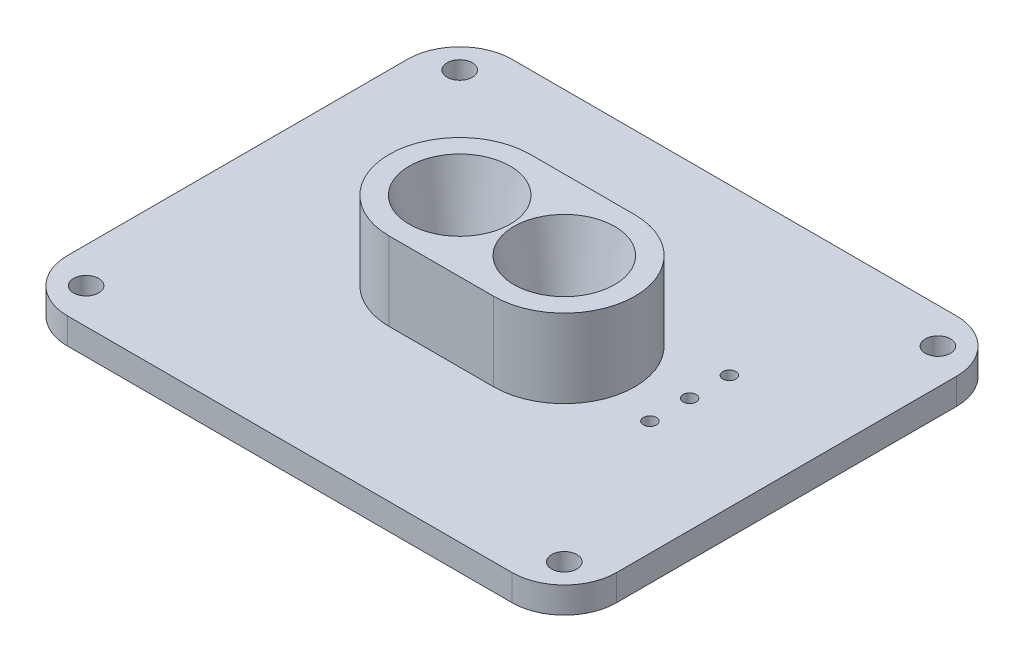
ISO-10303-21;
HEADER;
FILE_DESCRIPTION(('STEP AP214'),'2;1');
FILE_NAME('part.step','',(''),(''),'','','');
FILE_SCHEMA(('AUTOMOTIVE_DESIGN { 1 0 10303 214 1 1 1 1 }'));
ENDSEC;
DATA;
#1=APPLICATION_CONTEXT('core data for automotive mechanical design processes');
#2=APPLICATION_PROTOCOL_DEFINITION('international standard','automotive_design',2000,#1);
#3=PRODUCT_CONTEXT('',#1,'mechanical');
#4=PRODUCT('Part','Part','',(#3));
#5=PRODUCT_RELATED_PRODUCT_CATEGORY('part','',(#4));
#6=PRODUCT_DEFINITION_FORMATION('','',#4);
#7=PRODUCT_DEFINITION_CONTEXT('part definition',#1,'design');
#8=PRODUCT_DEFINITION('design','',#6,#7);
#9=PRODUCT_DEFINITION_SHAPE('','',#8);
#10=(LENGTH_UNIT() NAMED_UNIT(*) SI_UNIT(.MILLI.,.METRE.));
#11=(NAMED_UNIT(*) PLANE_ANGLE_UNIT() SI_UNIT($,.RADIAN.));
#12=(NAMED_UNIT(*) SI_UNIT($,.STERADIAN.) SOLID_ANGLE_UNIT());
#13=UNCERTAINTY_MEASURE_WITH_UNIT(LENGTH_MEASURE(1.E-05),#10,'distance_accuracy_value','');
#14=(GEOMETRIC_REPRESENTATION_CONTEXT(3) GLOBAL_UNCERTAINTY_ASSIGNED_CONTEXT((#13)) GLOBAL_UNIT_ASSIGNED_CONTEXT((#10,
#11,#12)) REPRESENTATION_CONTEXT('',''));
#15=CARTESIAN_POINT('',(0.,0.,0.));
#16=DIRECTION('',(0.,0.,1.));
#17=DIRECTION('',(1.,0.,0.));
#18=AXIS2_PLACEMENT_3D('',#15,#16,#17);
#19=CARTESIAN_POINT('',(-19.6451080879502,97.8379830194114,147.403503967917));
#20=DIRECTION('',(0.,1.,0.));
#21=DIRECTION('',(0.,0.,1.));
#22=AXIS2_PLACEMENT_3D('',#19,#20,#21);
#23=PLANE('',#22);
#24=CARTESIAN_POINT('',(73.2236419120498,97.8379830194114,111.526003967917));
#25=DIRECTION('',(0.,1.,0.));
#26=DIRECTION('',(0.,0.,1.));
#27=AXIS2_PLACEMENT_3D('',#24,#25,#26);
#28=CIRCLE('',#27,1.58749999999999);
#29=CARTESIAN_POINT('',(73.2236419120498,97.8379830194114,113.113503967917));
#30=VERTEX_POINT('',#29);
#31=EDGE_CURVE('E208',#30,#30,#28,.T.);
#32=ORIENTED_EDGE('',*,*,#31,.F.);
#33=EDGE_LOOP('',(#32));
#34=FACE_BOUND('',#33,.T.);
#35=CARTESIAN_POINT('',(73.2236419120498,97.8379830194114,101.874003967917));
#36=DIRECTION('',(0.,1.,0.));
#37=DIRECTION('',(0.,0.,1.));
#38=AXIS2_PLACEMENT_3D('',#35,#36,#37);
#39=CIRCLE('',#38,1.58749999999999);
#40=CARTESIAN_POINT('',(73.2236419120498,97.8379830194114,103.461503967917));
#41=VERTEX_POINT('',#40);
#42=EDGE_CURVE('E214',#41,#41,#39,.T.);
#43=ORIENTED_EDGE('',*,*,#42,.F.);
#44=EDGE_LOOP('',(#43));
#45=FACE_BOUND('',#44,.T.);
#46=CARTESIAN_POINT('',(73.2236419120498,97.8379830194114,92.2220039679169));
#47=DIRECTION('',(0.,1.,0.));
#48=DIRECTION('',(0.,0.,1.));
#49=AXIS2_PLACEMENT_3D('',#46,#47,#48);
#50=CIRCLE('',#49,1.58749999999999);
#51=CARTESIAN_POINT('',(73.2236419120498,97.8379830194114,93.8095039679169));
#52=VERTEX_POINT('',#51);
#53=EDGE_CURVE('E192',#52,#52,#50,.T.);
#54=ORIENTED_EDGE('',*,*,#53,.F.);
#55=EDGE_LOOP('',(#54));
#56=FACE_BOUND('',#55,.T.);
#57=CARTESIAN_POINT('',(92.4006419120498,97.8379830194114,151.499253967917));
#58=DIRECTION('',(0.,1.,0.));
#59=DIRECTION('',(0.,0.,1.));
#60=AXIS2_PLACEMENT_3D('',#57,#58,#59);
#61=CIRCLE('',#60,3.0607);
#62=CARTESIAN_POINT('',(92.4006419120498,97.8379830194114,154.559953967917));
#63=VERTEX_POINT('',#62);
#64=EDGE_CURVE('E262',#63,#63,#61,.T.);
#65=ORIENTED_EDGE('',*,*,#64,.F.);
#66=EDGE_LOOP('',(#65));
#67=FACE_BOUND('',#66,.T.);
#68=CARTESIAN_POINT('',(-23.7408580879502,97.8379830194114,60.7577539679169));
#69=DIRECTION('',(0.,1.,0.));
#70=DIRECTION('',(0.,0.,1.));
#71=AXIS2_PLACEMENT_3D('',#68,#69,#70);
#72=CIRCLE('',#71,3.06069999999998);
#73=CARTESIAN_POINT('',(-23.7408580879502,97.8379830194114,63.8184539679169));
#74=VERTEX_POINT('',#73);
#75=EDGE_CURVE('E274',#74,#74,#72,.T.);
#76=ORIENTED_EDGE('',*,*,#75,.F.);
#77=EDGE_LOOP('',(#76));
#78=FACE_BOUND('',#77,.T.);
#79=CARTESIAN_POINT('',(-23.7408580879502,97.8379830194114,151.499253967917));
#80=DIRECTION('',(0.,1.,0.));
#81=DIRECTION('',(0.,0.,1.));
#82=AXIS2_PLACEMENT_3D('',#79,#80,#81);
#83=CIRCLE('',#82,3.06069999999999);
#84=CARTESIAN_POINT('',(-23.7408580879502,97.8379830194114,154.559953967917));
#85=VERTEX_POINT('',#84);
#86=EDGE_CURVE('E11',#85,#85,#83,.T.);
#87=ORIENTED_EDGE('',*,*,#86,.F.);
#88=EDGE_LOOP('',(#87));
#89=FACE_BOUND('',#88,.T.);
#90=CARTESIAN_POINT('',(92.4006419120498,97.8379830194114,60.7577539679169));
#91=DIRECTION('',(0.,1.,0.));
#92=DIRECTION('',(0.,0.,1.));
#93=AXIS2_PLACEMENT_3D('',#90,#91,#92);
#94=CIRCLE('',#93,3.06069999999999);
#95=CARTESIAN_POINT('',(92.4006419120498,97.8379830194114,63.8184539679169));
#96=VERTEX_POINT('',#95);
#97=EDGE_CURVE('E268',#96,#96,#94,.T.);
#98=ORIENTED_EDGE('',*,*,#97,.F.);
#99=EDGE_LOOP('',(#98));
#100=FACE_BOUND('',#99,.T.);
#101=DIRECTION('',(1.,0.,0.));
#102=VECTOR('',#101,1.);
#103=CARTESIAN_POINT('',(21.6298919120498,97.8379830194114,123.273503967917));
#104=LINE('',#103,#102);
#105=CARTESIAN_POINT('',(21.6298919120498,97.8379830194114,123.273503967917));
#106=VERTEX_POINT('',#105);
#107=CARTESIAN_POINT('',(47.0298919120498,97.8379830194114,123.273503967917));
#108=VERTEX_POINT('',#107);
#109=EDGE_CURVE('E243',#106,#108,#104,.T.);
#110=ORIENTED_EDGE('',*,*,#109,.F.);
#111=CARTESIAN_POINT('',(21.6298919120498,97.8379830194114,106.128503967917));
#112=DIRECTION('',(0.,1.,0.));
#113=DIRECTION('',(0.,0.,1.));
#114=AXIS2_PLACEMENT_3D('',#111,#112,#113);
#115=CIRCLE('',#114,17.145);
#116=CARTESIAN_POINT('',(21.6298919120498,97.8379830194114,88.9835039679169));
#117=VERTEX_POINT('',#116);
#118=EDGE_CURVE('E229',#117,#106,#115,.T.);
#119=ORIENTED_EDGE('',*,*,#118,.F.);
#120=DIRECTION('',(-1.,0.,0.));
#121=VECTOR('',#120,1.);
#122=CARTESIAN_POINT('',(21.6298919120498,97.8379830194114,88.9835039679169));
#123=LINE('',#122,#121);
#124=CARTESIAN_POINT('',(47.0298919120498,97.8379830194114,88.9835039679169));
#125=VERTEX_POINT('',#124);
#126=EDGE_CURVE('E71',#125,#117,#123,.T.);
#127=ORIENTED_EDGE('',*,*,#126,.F.);
#128=CARTESIAN_POINT('',(47.0298919120498,97.8379830194114,106.128503967917));
#129=DIRECTION('',(0.,1.,0.));
#130=DIRECTION('',(0.,0.,1.));
#131=AXIS2_PLACEMENT_3D('',#128,#129,#130);
#132=CIRCLE('',#131,17.145);
#133=EDGE_CURVE('E245',#108,#125,#132,.T.);
#134=ORIENTED_EDGE('',*,*,#133,.F.);
#135=EDGE_LOOP('',(#110,#119,#127,#134));
#136=FACE_BOUND('',#135,.T.);
#137=CARTESIAN_POINT('',(-19.6451080879502,97.8379830194114,64.8535039679169));
#138=DIRECTION('',(0.,1.,0.));
#139=DIRECTION('',(0.,0.,1.));
#140=AXIS2_PLACEMENT_3D('',#137,#138,#139);
#141=CIRCLE('',#140,12.7);
#142=CARTESIAN_POINT('',(-19.6451080879501,97.8379830194114,52.1535039679169));
#143=VERTEX_POINT('',#142);
#144=CARTESIAN_POINT('',(-32.3451080879502,97.8379830194114,64.853503967917));
#145=VERTEX_POINT('',#144);
#146=EDGE_CURVE('E174',#143,#145,#141,.T.);
#147=ORIENTED_EDGE('',*,*,#146,.T.);
#148=DIRECTION('',(0.,0.,1.));
#149=VECTOR('',#148,1.);
#150=CARTESIAN_POINT('',(-32.3451080879502,97.8379830194114,64.853503967917));
#151=LINE('',#150,#149);
#152=CARTESIAN_POINT('',(-32.3451080879502,97.8379830194114,147.403503967917));
#153=VERTEX_POINT('',#152);
#154=EDGE_CURVE('E134',#145,#153,#151,.T.);
#155=ORIENTED_EDGE('',*,*,#154,.T.);
#156=CARTESIAN_POINT('',(-19.6451080879502,97.8379830194114,147.403503967917));
#157=DIRECTION('',(0.,1.,0.));
#158=DIRECTION('',(0.,0.,1.));
#159=AXIS2_PLACEMENT_3D('',#156,#157,#158);
#160=CIRCLE('',#159,12.7);
#161=CARTESIAN_POINT('',(-19.6451080879502,97.8379830194114,160.103503967917));
#162=VERTEX_POINT('',#161);
#163=EDGE_CURVE('E177',#153,#162,#160,.T.);
#164=ORIENTED_EDGE('',*,*,#163,.T.);
#165=DIRECTION('',(1.,0.,0.));
#166=VECTOR('',#165,1.);
#167=CARTESIAN_POINT('',(-19.6451080879501,97.8379830194114,160.103503967917));
#168=LINE('',#167,#166);
#169=CARTESIAN_POINT('',(88.3048919120497,97.8379830194114,160.103503967917));
#170=VERTEX_POINT('',#169);
#171=EDGE_CURVE('E180',#162,#170,#168,.T.);
#172=ORIENTED_EDGE('',*,*,#171,.T.);
#173=CARTESIAN_POINT('',(88.3048919120498,97.8379830194114,147.403503967917));
#174=DIRECTION('',(0.,1.,0.));
#175=DIRECTION('',(0.,0.,1.));
#176=AXIS2_PLACEMENT_3D('',#173,#174,#175);
#177=CIRCLE('',#176,12.7);
#178=CARTESIAN_POINT('',(101.00489191205,97.8379830194114,147.403503967917));
#179=VERTEX_POINT('',#178);
#180=EDGE_CURVE('E183',#170,#179,#177,.T.);
#181=ORIENTED_EDGE('',*,*,#180,.T.);
#182=DIRECTION('',(0.,0.,-1.));
#183=VECTOR('',#182,1.);
#184=CARTESIAN_POINT('',(101.00489191205,97.8379830194114,147.403503967917));
#185=LINE('',#184,#183);
#186=CARTESIAN_POINT('',(101.00489191205,97.8379830194114,64.853503967917));
#187=VERTEX_POINT('',#186);
#188=EDGE_CURVE('E186',#179,#187,#185,.T.);
#189=ORIENTED_EDGE('',*,*,#188,.T.);
#190=CARTESIAN_POINT('',(88.3048919120498,97.8379830194114,64.8535039679169));
#191=DIRECTION('',(0.,1.,0.));
#192=DIRECTION('',(0.,0.,1.));
#193=AXIS2_PLACEMENT_3D('',#190,#191,#192);
#194=CIRCLE('',#193,12.7);
#195=CARTESIAN_POINT('',(88.3048919120497,97.8379830194114,52.1535039679169));
#196=VERTEX_POINT('',#195);
#197=EDGE_CURVE('E157',#187,#196,#194,.T.);
#198=ORIENTED_EDGE('',*,*,#197,.T.);
#199=DIRECTION('',(-1.,0.,0.));
#200=VECTOR('',#199,1.);
#201=CARTESIAN_POINT('',(88.3048919120497,97.8379830194114,52.1535039679169));
#202=LINE('',#201,#200);
#203=EDGE_CURVE('E154',#196,#143,#202,.T.);
#204=ORIENTED_EDGE('',*,*,#203,.T.);
#205=EDGE_LOOP('',(#147,#155,#164,#172,#181,#189,#198,#204));
#206=FACE_BOUND('',#205,.T.);
#207=ADVANCED_FACE('F33',(#34,#45,#56,#67,#78,#89,#100,#136,#206),#23,.T.);
#208=CARTESIAN_POINT('',(-19.6451080879502,91.4879830194114,147.403503967917));
#209=DIRECTION('',(0.,1.,0.));
#210=DIRECTION('',(0.,0.,1.));
#211=AXIS2_PLACEMENT_3D('',#208,#209,#210);
#212=PLANE('',#211);
#213=CARTESIAN_POINT('',(73.2236419120498,91.4879830194114,111.526003967917));
#214=DIRECTION('',(0.,1.,0.));
#215=DIRECTION('',(0.,0.,1.));
#216=AXIS2_PLACEMENT_3D('',#213,#214,#215);
#217=CIRCLE('',#216,1.58749999999999);
#218=CARTESIAN_POINT('',(73.2236419120498,91.4879830194114,113.113503967917));
#219=VERTEX_POINT('',#218);
#220=EDGE_CURVE('E204',#219,#219,#217,.T.);
#221=ORIENTED_EDGE('',*,*,#220,.T.);
#222=EDGE_LOOP('',(#221));
#223=FACE_BOUND('',#222,.T.);
#224=CARTESIAN_POINT('',(73.2236419120498,91.4879830194114,101.874003967917));
#225=DIRECTION('',(0.,1.,0.));
#226=DIRECTION('',(0.,0.,1.));
#227=AXIS2_PLACEMENT_3D('',#224,#225,#226);
#228=CIRCLE('',#227,1.58749999999999);
#229=CARTESIAN_POINT('',(73.2236419120498,91.4879830194114,103.461503967917));
#230=VERTEX_POINT('',#229);
#231=EDGE_CURVE('E211',#230,#230,#228,.T.);
#232=ORIENTED_EDGE('',*,*,#231,.T.);
#233=EDGE_LOOP('',(#232));
#234=FACE_BOUND('',#233,.T.);
#235=CARTESIAN_POINT('',(73.2236419120498,91.4879830194114,92.2220039679169));
#236=DIRECTION('',(0.,1.,0.));
#237=DIRECTION('',(0.,0.,1.));
#238=AXIS2_PLACEMENT_3D('',#235,#236,#237);
#239=CIRCLE('',#238,1.58749999999999);
#240=CARTESIAN_POINT('',(73.2236419120498,91.4879830194114,93.8095039679169));
#241=VERTEX_POINT('',#240);
#242=EDGE_CURVE('E217',#241,#241,#239,.T.);
#243=ORIENTED_EDGE('',*,*,#242,.T.);
#244=EDGE_LOOP('',(#243));
#245=FACE_BOUND('',#244,.T.);
#246=CARTESIAN_POINT('',(47.0298919120498,91.4879830194114,106.128503967917));
#247=DIRECTION('',(0.,-1.,0.));
#248=DIRECTION('',(0.,0.,-1.));
#249=AXIS2_PLACEMENT_3D('',#246,#247,#248);
#250=CIRCLE('',#249,8.20039);
#251=CARTESIAN_POINT('',(47.0298919120498,91.4879830194114,97.9281139679169));
#252=VERTEX_POINT('',#251);
#253=EDGE_CURVE('E256',#252,#252,#250,.T.);
#254=ORIENTED_EDGE('',*,*,#253,.F.);
#255=EDGE_LOOP('',(#254));
#256=FACE_BOUND('',#255,.T.);
#257=CARTESIAN_POINT('',(21.6298919120498,91.4879830194114,106.128503967917));
#258=DIRECTION('',(0.,-1.,0.));
#259=DIRECTION('',(0.,0.,-1.));
#260=AXIS2_PLACEMENT_3D('',#257,#258,#259);
#261=CIRCLE('',#260,8.20039);
#262=CARTESIAN_POINT('',(21.6298919120498,91.4879830194114,97.9281139679169));
#263=VERTEX_POINT('',#262);
#264=EDGE_CURVE('E255',#263,#263,#261,.T.);
#265=ORIENTED_EDGE('',*,*,#264,.F.);
#266=EDGE_LOOP('',(#265));
#267=FACE_BOUND('',#266,.T.);
#268=CARTESIAN_POINT('',(-23.7408580879502,91.4879830194114,151.499253967917));
#269=DIRECTION('',(0.,1.,0.));
#270=DIRECTION('',(0.,0.,1.));
#271=AXIS2_PLACEMENT_3D('',#268,#269,#270);
#272=CIRCLE('',#271,3.06069999999999);
#273=CARTESIAN_POINT('',(-23.7408580879502,91.4879830194114,154.559953967917));
#274=VERTEX_POINT('',#273);
#275=EDGE_CURVE('E37',#274,#274,#272,.T.);
#276=ORIENTED_EDGE('',*,*,#275,.T.);
#277=EDGE_LOOP('',(#276));
#278=FACE_BOUND('',#277,.T.);
#279=CARTESIAN_POINT('',(-23.7408580879502,91.4879830194114,60.7577539679169));
#280=DIRECTION('',(0.,1.,0.));
#281=DIRECTION('',(0.,0.,1.));
#282=AXIS2_PLACEMENT_3D('',#279,#280,#281);
#283=CIRCLE('',#282,3.06069999999998);
#284=CARTESIAN_POINT('',(-23.7408580879502,91.4879830194114,63.8184539679169));
#285=VERTEX_POINT('',#284);
#286=EDGE_CURVE('E271',#285,#285,#283,.T.);
#287=ORIENTED_EDGE('',*,*,#286,.T.);
#288=EDGE_LOOP('',(#287));
#289=FACE_BOUND('',#288,.T.);
#290=CARTESIAN_POINT('',(92.4006419120498,91.4879830194114,60.7577539679169));
#291=DIRECTION('',(0.,1.,0.));
#292=DIRECTION('',(0.,0.,1.));
#293=AXIS2_PLACEMENT_3D('',#290,#291,#292);
#294=CIRCLE('',#293,3.06069999999999);
#295=CARTESIAN_POINT('',(92.4006419120498,91.4879830194114,63.8184539679169));
#296=VERTEX_POINT('',#295);
#297=EDGE_CURVE('E265',#296,#296,#294,.T.);
#298=ORIENTED_EDGE('',*,*,#297,.T.);
#299=EDGE_LOOP('',(#298));
#300=FACE_BOUND('',#299,.T.);
#301=CARTESIAN_POINT('',(92.4006419120498,91.4879830194114,151.499253967917));
#302=DIRECTION('',(0.,1.,0.));
#303=DIRECTION('',(0.,0.,1.));
#304=AXIS2_PLACEMENT_3D('',#301,#302,#303);
#305=CIRCLE('',#304,3.0607);
#306=CARTESIAN_POINT('',(92.4006419120498,91.4879830194114,154.559953967917));
#307=VERTEX_POINT('',#306);
#308=EDGE_CURVE('E259',#307,#307,#305,.T.);
#309=ORIENTED_EDGE('',*,*,#308,.T.);
#310=EDGE_LOOP('',(#309));
#311=FACE_BOUND('',#310,.T.);
#312=CARTESIAN_POINT('',(-19.6451080879502,91.4879830194114,64.8535039679169));
#313=DIRECTION('',(0.,1.,0.));
#314=DIRECTION('',(0.,0.,1.));
#315=AXIS2_PLACEMENT_3D('',#312,#313,#314);
#316=CIRCLE('',#315,12.7);
#317=CARTESIAN_POINT('',(-19.6451080879501,91.4879830194114,52.1535039679169));
#318=VERTEX_POINT('',#317);
#319=CARTESIAN_POINT('',(-32.3451080879502,91.4879830194114,64.853503967917));
#320=VERTEX_POINT('',#319);
#321=EDGE_CURVE('E146',#318,#320,#316,.T.);
#322=ORIENTED_EDGE('',*,*,#321,.F.);
#323=DIRECTION('',(-1.,0.,0.));
#324=VECTOR('',#323,1.);
#325=CARTESIAN_POINT('',(88.3048919120497,91.4879830194114,52.1535039679169));
#326=LINE('',#325,#324);
#327=CARTESIAN_POINT('',(88.3048919120497,91.4879830194114,52.1535039679169));
#328=VERTEX_POINT('',#327);
#329=EDGE_CURVE('E140',#328,#318,#326,.T.);
#330=ORIENTED_EDGE('',*,*,#329,.F.);
#331=CARTESIAN_POINT('',(88.3048919120498,91.4879830194114,64.8535039679169));
#332=DIRECTION('',(0.,1.,0.));
#333=DIRECTION('',(0.,0.,1.));
#334=AXIS2_PLACEMENT_3D('',#331,#332,#333);
#335=CIRCLE('',#334,12.7);
#336=CARTESIAN_POINT('',(101.00489191205,91.4879830194114,64.853503967917));
#337=VERTEX_POINT('',#336);
#338=EDGE_CURVE('E170',#337,#328,#335,.T.);
#339=ORIENTED_EDGE('',*,*,#338,.F.);
#340=DIRECTION('',(0.,0.,-1.));
#341=VECTOR('',#340,1.);
#342=CARTESIAN_POINT('',(101.00489191205,91.4879830194114,147.403503967917));
#343=LINE('',#342,#341);
#344=CARTESIAN_POINT('',(101.00489191205,91.4879830194114,147.403503967917));
#345=VERTEX_POINT('',#344);
#346=EDGE_CURVE('E167',#345,#337,#343,.T.);
#347=ORIENTED_EDGE('',*,*,#346,.F.);
#348=CARTESIAN_POINT('',(88.3048919120498,91.4879830194114,147.403503967917));
#349=DIRECTION('',(0.,1.,0.));
#350=DIRECTION('',(0.,0.,1.));
#351=AXIS2_PLACEMENT_3D('',#348,#349,#350);
#352=CIRCLE('',#351,12.7);
#353=CARTESIAN_POINT('',(88.3048919120497,91.4879830194114,160.103503967917));
#354=VERTEX_POINT('',#353);
#355=EDGE_CURVE('E164',#354,#345,#352,.T.);
#356=ORIENTED_EDGE('',*,*,#355,.F.);
#357=DIRECTION('',(1.,0.,0.));
#358=VECTOR('',#357,1.);
#359=CARTESIAN_POINT('',(-19.6451080879501,91.4879830194114,160.103503967917));
#360=LINE('',#359,#358);
#361=CARTESIAN_POINT('',(-19.6451080879502,91.4879830194114,160.103503967917));
#362=VERTEX_POINT('',#361);
#363=EDGE_CURVE('E161',#362,#354,#360,.T.);
#364=ORIENTED_EDGE('',*,*,#363,.F.);
#365=CARTESIAN_POINT('',(-19.6451080879502,91.4879830194114,147.403503967917));
#366=DIRECTION('',(0.,1.,0.));
#367=DIRECTION('',(0.,0.,1.));
#368=AXIS2_PLACEMENT_3D('',#365,#366,#367);
#369=CIRCLE('',#368,12.7);
#370=CARTESIAN_POINT('',(-32.3451080879502,91.4879830194114,147.403503967917));
#371=VERTEX_POINT('',#370);
#372=EDGE_CURVE('E150',#371,#362,#369,.T.);
#373=ORIENTED_EDGE('',*,*,#372,.F.);
#374=DIRECTION('',(0.,0.,1.));
#375=VECTOR('',#374,1.);
#376=CARTESIAN_POINT('',(-32.3451080879502,91.4879830194114,64.853503967917));
#377=LINE('',#376,#375);
#378=EDGE_CURVE('E132',#320,#371,#377,.T.);
#379=ORIENTED_EDGE('',*,*,#378,.F.);
#380=EDGE_LOOP('',(#322,#330,#339,#347,#356,#364,#373,#379));
#381=FACE_BOUND('',#380,.T.);
#382=ADVANCED_FACE('F35',(#223,#234,#245,#256,#267,#278,#289,#300,#311,#381),#212,.F.);
#383=CARTESIAN_POINT('',(-23.7408580879502,97.8379830194114,151.499253967917));
#384=DIRECTION('',(0.,-1.,0.));
#385=DIRECTION('',(0.,0.,-1.));
#386=AXIS2_PLACEMENT_3D('',#383,#384,#385);
#387=CYLINDRICAL_SURFACE('',#386,3.06069999999999);
#388=ORIENTED_EDGE('',*,*,#86,.T.);
#389=EDGE_LOOP('',(#388));
#390=FACE_BOUND('',#389,.T.);
#391=ORIENTED_EDGE('',*,*,#275,.F.);
#392=EDGE_LOOP('',(#391));
#393=FACE_BOUND('',#392,.T.);
#394=ADVANCED_FACE('F285',(#390,#393),#387,.F.);
#395=CARTESIAN_POINT('',(-23.7408580879502,97.8379830194114,60.7577539679169));
#396=DIRECTION('',(0.,-1.,0.));
#397=DIRECTION('',(0.,0.,-1.));
#398=AXIS2_PLACEMENT_3D('',#395,#396,#397);
#399=CYLINDRICAL_SURFACE('',#398,3.06069999999998);
#400=ORIENTED_EDGE('',*,*,#75,.T.);
#401=EDGE_LOOP('',(#400));
#402=FACE_BOUND('',#401,.T.);
#403=ORIENTED_EDGE('',*,*,#286,.F.);
#404=EDGE_LOOP('',(#403));
#405=FACE_BOUND('',#404,.T.);
#406=ADVANCED_FACE('F282',(#402,#405),#399,.F.);
#407=CARTESIAN_POINT('',(92.4006419120498,97.8379830194114,60.7577539679169));
#408=DIRECTION('',(0.,-1.,0.));
#409=DIRECTION('',(0.,0.,-1.));
#410=AXIS2_PLACEMENT_3D('',#407,#408,#409);
#411=CYLINDRICAL_SURFACE('',#410,3.06069999999999);
#412=ORIENTED_EDGE('',*,*,#97,.T.);
#413=EDGE_LOOP('',(#412));
#414=FACE_BOUND('',#413,.T.);
#415=ORIENTED_EDGE('',*,*,#297,.F.);
#416=EDGE_LOOP('',(#415));
#417=FACE_BOUND('',#416,.T.);
#418=ADVANCED_FACE('F284',(#414,#417),#411,.F.);
#419=CARTESIAN_POINT('',(92.4006419120498,97.8379830194114,151.499253967917));
#420=DIRECTION('',(0.,-1.,0.));
#421=DIRECTION('',(0.,0.,-1.));
#422=AXIS2_PLACEMENT_3D('',#419,#420,#421);
#423=CYLINDRICAL_SURFACE('',#422,3.0607);
#424=ORIENTED_EDGE('',*,*,#64,.T.);
#425=EDGE_LOOP('',(#424));
#426=FACE_BOUND('',#425,.T.);
#427=ORIENTED_EDGE('',*,*,#308,.F.);
#428=EDGE_LOOP('',(#427));
#429=FACE_BOUND('',#428,.T.);
#430=ADVANCED_FACE('F292',(#426,#429),#423,.F.);
#431=CARTESIAN_POINT('',(21.6298919120498,97.8379830194114,106.128503967917));
#432=DIRECTION('',(0.,-1.,0.));
#433=DIRECTION('',(0.,0.,-1.));
#434=AXIS2_PLACEMENT_3D('',#431,#432,#433);
#435=CYLINDRICAL_SURFACE('',#434,8.20039);
#436=CARTESIAN_POINT('',(21.6298919120498,97.8379830194114,106.128503967917));
#437=DIRECTION('',(0.,-1.,0.));
#438=DIRECTION('',(0.,0.,-1.));
#439=AXIS2_PLACEMENT_3D('',#436,#437,#438);
#440=CIRCLE('',#439,8.20039);
#441=CARTESIAN_POINT('',(21.6298919120498,97.8379830194114,97.9281139679169));
#442=VERTEX_POINT('',#441);
#443=EDGE_CURVE('E222',#442,#442,#440,.T.);
#444=ORIENTED_EDGE('',*,*,#443,.F.);
#445=EDGE_LOOP('',(#444));
#446=FACE_BOUND('',#445,.T.);
#447=ORIENTED_EDGE('',*,*,#264,.T.);
#448=EDGE_LOOP('',(#447));
#449=FACE_BOUND('',#448,.T.);
#450=ADVANCED_FACE('F394',(#446,#449),#435,.F.);
#451=CARTESIAN_POINT('',(47.0298919120498,97.8379830194114,106.128503967917));
#452=DIRECTION('',(0.,-1.,0.));
#453=DIRECTION('',(0.,0.,-1.));
#454=AXIS2_PLACEMENT_3D('',#451,#452,#453);
#455=CYLINDRICAL_SURFACE('',#454,8.20039);
#456=CARTESIAN_POINT('',(47.0298919120498,97.8379830194114,106.128503967917));
#457=DIRECTION('',(0.,-1.,0.));
#458=DIRECTION('',(0.,0.,-1.));
#459=AXIS2_PLACEMENT_3D('',#456,#457,#458);
#460=CIRCLE('',#459,8.20039);
#461=CARTESIAN_POINT('',(47.0298919120498,97.8379830194114,97.9281139679169));
#462=VERTEX_POINT('',#461);
#463=EDGE_CURVE('E207',#462,#462,#460,.T.);
#464=ORIENTED_EDGE('',*,*,#463,.F.);
#465=EDGE_LOOP('',(#464));
#466=FACE_BOUND('',#465,.T.);
#467=ORIENTED_EDGE('',*,*,#253,.T.);
#468=EDGE_LOOP('',(#467));
#469=FACE_BOUND('',#468,.T.);
#470=ADVANCED_FACE('F390',(#466,#469),#455,.F.);
#471=CARTESIAN_POINT('',(21.6298919120498,116.887983019411,106.128503967917));
#472=DIRECTION('',(0.,-1.,0.));
#473=DIRECTION('',(0.,0.,-1.));
#474=AXIS2_PLACEMENT_3D('',#471,#472,#473);
#475=CYLINDRICAL_SURFACE('',#474,17.145);
#476=ORIENTED_EDGE('',*,*,#118,.T.);
#477=DIRECTION('',(0.,-1.,0.));
#478=VECTOR('',#477,1.);
#479=CARTESIAN_POINT('',(21.6298919120498,116.887983019411,123.273503967917));
#480=LINE('',#479,#478);
#481=CARTESIAN_POINT('',(21.6298919120498,116.887983019411,123.273503967917));
#482=VERTEX_POINT('',#481);
#483=EDGE_CURVE('E253',#482,#106,#480,.T.);
#484=ORIENTED_EDGE('',*,*,#483,.F.);
#485=CARTESIAN_POINT('',(21.6298919120498,116.887983019411,106.128503967917));
#486=DIRECTION('',(0.,1.,0.));
#487=DIRECTION('',(0.,0.,1.));
#488=AXIS2_PLACEMENT_3D('',#485,#486,#487);
#489=CIRCLE('',#488,17.145);
#490=CARTESIAN_POINT('',(21.6298919120498,116.887983019411,88.9835039679169));
#491=VERTEX_POINT('',#490);
#492=EDGE_CURVE('E234',#491,#482,#489,.T.);
#493=ORIENTED_EDGE('',*,*,#492,.F.);
#494=DIRECTION('',(0.,-1.,0.));
#495=VECTOR('',#494,1.);
#496=CARTESIAN_POINT('',(21.6298919120498,116.887983019411,88.9835039679169));
#497=LINE('',#496,#495);
#498=EDGE_CURVE('E240',#491,#117,#497,.T.);
#499=ORIENTED_EDGE('',*,*,#498,.T.);
#500=EDGE_LOOP('',(#476,#484,#493,#499));
#501=FACE_BOUND('',#500,.T.);
#502=ADVANCED_FACE('F387',(#501),#475,.T.);
#503=CARTESIAN_POINT('',(21.6298919120498,116.887983019411,123.273503967917));
#504=DIRECTION('',(0.,0.,-1.));
#505=DIRECTION('',(-1.,0.,0.));
#506=AXIS2_PLACEMENT_3D('',#503,#504,#505);
#507=PLANE('',#506);
#508=ORIENTED_EDGE('',*,*,#109,.T.);
#509=DIRECTION('',(0.,-1.,0.));
#510=VECTOR('',#509,1.);
#511=CARTESIAN_POINT('',(47.0298919120498,116.887983019411,123.273503967917));
#512=LINE('',#511,#510);
#513=CARTESIAN_POINT('',(47.0298919120498,116.887983019411,123.273503967917));
#514=VERTEX_POINT('',#513);
#515=EDGE_CURVE('E250',#514,#108,#512,.T.);
#516=ORIENTED_EDGE('',*,*,#515,.F.);
#517=DIRECTION('',(1.,0.,0.));
#518=VECTOR('',#517,1.);
#519=CARTESIAN_POINT('',(21.6298919120498,116.887983019411,123.273503967917));
#520=LINE('',#519,#518);
#521=EDGE_CURVE('E78',#482,#514,#520,.T.);
#522=ORIENTED_EDGE('',*,*,#521,.F.);
#523=ORIENTED_EDGE('',*,*,#483,.T.);
#524=EDGE_LOOP('',(#508,#516,#522,#523));
#525=FACE_BOUND('',#524,.T.);
#526=ADVANCED_FACE('F383',(#525),#507,.F.);
#527=CARTESIAN_POINT('',(47.0298919120498,116.887983019411,106.128503967917));
#528=DIRECTION('',(0.,-1.,0.));
#529=DIRECTION('',(0.,0.,-1.));
#530=AXIS2_PLACEMENT_3D('',#527,#528,#529);
#531=CYLINDRICAL_SURFACE('',#530,17.145);
#532=ORIENTED_EDGE('',*,*,#133,.T.);
#533=DIRECTION('',(0.,-1.,0.));
#534=VECTOR('',#533,1.);
#535=CARTESIAN_POINT('',(47.0298919120498,116.887983019411,88.9835039679169));
#536=LINE('',#535,#534);
#537=CARTESIAN_POINT('',(47.0298919120498,116.887983019411,88.9835039679169));
#538=VERTEX_POINT('',#537);
#539=EDGE_CURVE('E48',#538,#125,#536,.T.);
#540=ORIENTED_EDGE('',*,*,#539,.F.);
#541=CARTESIAN_POINT('',(47.0298919120498,116.887983019411,106.128503967917));
#542=DIRECTION('',(0.,1.,0.));
#543=DIRECTION('',(0.,0.,1.));
#544=AXIS2_PLACEMENT_3D('',#541,#542,#543);
#545=CIRCLE('',#544,17.145);
#546=EDGE_CURVE('E237',#514,#538,#545,.T.);
#547=ORIENTED_EDGE('',*,*,#546,.F.);
#548=ORIENTED_EDGE('',*,*,#515,.T.);
#549=EDGE_LOOP('',(#532,#540,#547,#548));
#550=FACE_BOUND('',#549,.T.);
#551=ADVANCED_FACE('F380',(#550),#531,.T.);
#552=CARTESIAN_POINT('',(21.6298919120498,116.887983019411,88.9835039679169));
#553=DIRECTION('',(0.,0.,1.));
#554=DIRECTION('',(1.,0.,0.));
#555=AXIS2_PLACEMENT_3D('',#552,#553,#554);
#556=PLANE('',#555);
#557=ORIENTED_EDGE('',*,*,#126,.T.);
#558=ORIENTED_EDGE('',*,*,#498,.F.);
#559=DIRECTION('',(-1.,0.,0.));
#560=VECTOR('',#559,1.);
#561=CARTESIAN_POINT('',(21.6298919120498,116.887983019411,88.9835039679169));
#562=LINE('',#561,#560);
#563=EDGE_CURVE('E56',#538,#491,#562,.T.);
#564=ORIENTED_EDGE('',*,*,#563,.F.);
#565=ORIENTED_EDGE('',*,*,#539,.T.);
#566=EDGE_LOOP('',(#557,#558,#564,#565));
#567=FACE_BOUND('',#566,.T.);
#568=ADVANCED_FACE('F376',(#567),#556,.F.);
#569=CARTESIAN_POINT('',(21.6298919120498,116.887983019411,106.128503967917));
#570=DIRECTION('',(0.,1.,0.));
#571=DIRECTION('',(0.,0.,1.));
#572=AXIS2_PLACEMENT_3D('',#569,#570,#571);
#573=PLANE('',#572);
#574=CARTESIAN_POINT('',(21.6298919120498,116.887983019411,106.128503967917));
#575=DIRECTION('',(0.,-1.,0.));
#576=DIRECTION('',(0.,0.,-1.));
#577=AXIS2_PLACEMENT_3D('',#574,#575,#576);
#578=CIRCLE('',#577,12.2495924998139);
#579=CARTESIAN_POINT('',(21.6298919120498,116.887983019411,93.878911468103));
#580=VERTEX_POINT('',#579);
#581=EDGE_CURVE('E225',#580,#580,#578,.T.);
#582=ORIENTED_EDGE('',*,*,#581,.T.);
#583=EDGE_LOOP('',(#582));
#584=FACE_BOUND('',#583,.T.);
#585=CARTESIAN_POINT('',(47.0298919120498,116.887983019411,106.128503967917));
#586=DIRECTION('',(0.,-1.,0.));
#587=DIRECTION('',(0.,0.,-1.));
#588=AXIS2_PLACEMENT_3D('',#585,#586,#587);
#589=CIRCLE('',#588,12.2495924998139);
#590=CARTESIAN_POINT('',(47.0298919120498,116.887983019411,93.878911468103));
#591=VERTEX_POINT('',#590);
#592=EDGE_CURVE('E226',#591,#591,#589,.T.);
#593=ORIENTED_EDGE('',*,*,#592,.T.);
#594=EDGE_LOOP('',(#593));
#595=FACE_BOUND('',#594,.T.);
#596=ORIENTED_EDGE('',*,*,#492,.T.);
#597=ORIENTED_EDGE('',*,*,#521,.T.);
#598=ORIENTED_EDGE('',*,*,#546,.T.);
#599=ORIENTED_EDGE('',*,*,#563,.T.);
#600=EDGE_LOOP('',(#596,#597,#598,#599));
#601=FACE_BOUND('',#600,.T.);
#602=ADVANCED_FACE('F372',(#584,#595,#601),#573,.T.);
#603=CARTESIAN_POINT('',(47.0298919120498,97.8379830194114,106.128503967917));
#604=DIRECTION('',(0.,1.,0.));
#605=DIRECTION('',(0.,0.,-1.));
#606=AXIS2_PLACEMENT_3D('',#603,#604,#605);
#607=CONICAL_SURFACE('',#606,8.20039,0.20943951023932);
#608=ORIENTED_EDGE('',*,*,#592,.F.);
#609=EDGE_LOOP('',(#608));
#610=FACE_BOUND('',#609,.T.);
#611=ORIENTED_EDGE('',*,*,#463,.T.);
#612=EDGE_LOOP('',(#611));
#613=FACE_BOUND('',#612,.T.);
#614=ADVANCED_FACE('F368',(#610,#613),#607,.F.);
#615=CARTESIAN_POINT('',(21.6298919120498,97.8379830194114,106.128503967917));
#616=DIRECTION('',(0.,1.,0.));
#617=DIRECTION('',(0.,0.,-1.));
#618=AXIS2_PLACEMENT_3D('',#615,#616,#617);
#619=CONICAL_SURFACE('',#618,8.20039,0.20943951023932);
#620=ORIENTED_EDGE('',*,*,#581,.F.);
#621=EDGE_LOOP('',(#620));
#622=FACE_BOUND('',#621,.T.);
#623=ORIENTED_EDGE('',*,*,#443,.T.);
#624=EDGE_LOOP('',(#623));
#625=FACE_BOUND('',#624,.T.);
#626=ADVANCED_FACE('F364',(#622,#625),#619,.F.);
#627=CARTESIAN_POINT('',(73.2236419120498,91.4879830194114,92.2220039679169));
#628=DIRECTION('',(0.,1.,0.));
#629=DIRECTION('',(0.,0.,1.));
#630=AXIS2_PLACEMENT_3D('',#627,#628,#629);
#631=CYLINDRICAL_SURFACE('',#630,1.58749999999999);
#632=ORIENTED_EDGE('',*,*,#242,.F.);
#633=EDGE_LOOP('',(#632));
#634=FACE_BOUND('',#633,.T.);
#635=ORIENTED_EDGE('',*,*,#53,.T.);
#636=EDGE_LOOP('',(#635));
#637=FACE_BOUND('',#636,.T.);
#638=ADVANCED_FACE('F360',(#634,#637),#631,.F.);
#639=CARTESIAN_POINT('',(73.2236419120498,91.4879830194114,101.874003967917));
#640=DIRECTION('',(0.,1.,0.));
#641=DIRECTION('',(0.,0.,1.));
#642=AXIS2_PLACEMENT_3D('',#639,#640,#641);
#643=CYLINDRICAL_SURFACE('',#642,1.58749999999999);
#644=ORIENTED_EDGE('',*,*,#231,.F.);
#645=EDGE_LOOP('',(#644));
#646=FACE_BOUND('',#645,.T.);
#647=ORIENTED_EDGE('',*,*,#42,.T.);
#648=EDGE_LOOP('',(#647));
#649=FACE_BOUND('',#648,.T.);
#650=ADVANCED_FACE('F356',(#646,#649),#643,.F.);
#651=CARTESIAN_POINT('',(73.2236419120498,91.4879830194114,111.526003967917));
#652=DIRECTION('',(0.,1.,0.));
#653=DIRECTION('',(0.,0.,1.));
#654=AXIS2_PLACEMENT_3D('',#651,#652,#653);
#655=CYLINDRICAL_SURFACE('',#654,1.58749999999999);
#656=ORIENTED_EDGE('',*,*,#220,.F.);
#657=EDGE_LOOP('',(#656));
#658=FACE_BOUND('',#657,.T.);
#659=ORIENTED_EDGE('',*,*,#31,.T.);
#660=EDGE_LOOP('',(#659));
#661=FACE_BOUND('',#660,.T.);
#662=ADVANCED_FACE('F353',(#658,#661),#655,.F.);
#663=CARTESIAN_POINT('',(-19.6451080879502,91.4879830194114,64.8535039679169));
#664=DIRECTION('',(0.,1.,0.));
#665=DIRECTION('',(0.,0.,1.));
#666=AXIS2_PLACEMENT_3D('',#663,#664,#665);
#667=CYLINDRICAL_SURFACE('',#666,12.7);
#668=ORIENTED_EDGE('',*,*,#146,.F.);
#669=DIRECTION('',(0.,1.,0.));
#670=VECTOR('',#669,1.);
#671=CARTESIAN_POINT('',(-19.6451080879501,91.4879830194114,52.1535039679169));
#672=LINE('',#671,#670);
#673=EDGE_CURVE('E153',#318,#143,#672,.T.);
#674=ORIENTED_EDGE('',*,*,#673,.F.);
#675=ORIENTED_EDGE('',*,*,#321,.T.);
#676=DIRECTION('',(0.,1.,0.));
#677=VECTOR('',#676,1.);
#678=CARTESIAN_POINT('',(-32.3451080879502,91.4879830194114,64.853503967917));
#679=LINE('',#678,#677);
#680=EDGE_CURVE('E129',#320,#145,#679,.T.);
#681=ORIENTED_EDGE('',*,*,#680,.T.);
#682=EDGE_LOOP('',(#668,#674,#675,#681));
#683=FACE_BOUND('',#682,.T.);
#684=ADVANCED_FACE('F152',(#683),#667,.T.);
#685=CARTESIAN_POINT('',(88.3048919120497,91.4879830194114,52.1535039679169));
#686=DIRECTION('',(0.,0.,-1.));
#687=DIRECTION('',(-1.,0.,0.));
#688=AXIS2_PLACEMENT_3D('',#685,#686,#687);
#689=PLANE('',#688);
#690=ORIENTED_EDGE('',*,*,#203,.F.);
#691=DIRECTION('',(0.,1.,0.));
#692=VECTOR('',#691,1.);
#693=CARTESIAN_POINT('',(88.3048919120497,91.4879830194114,52.1535039679169));
#694=LINE('',#693,#692);
#695=EDGE_CURVE('E193',#328,#196,#694,.T.);
#696=ORIENTED_EDGE('',*,*,#695,.F.);
#697=ORIENTED_EDGE('',*,*,#329,.T.);
#698=ORIENTED_EDGE('',*,*,#673,.T.);
#699=EDGE_LOOP('',(#690,#696,#697,#698));
#700=FACE_BOUND('',#699,.T.);
#701=ADVANCED_FACE('F324',(#700),#689,.T.);
#702=CARTESIAN_POINT('',(88.3048919120498,91.4879830194114,64.8535039679169));
#703=DIRECTION('',(0.,1.,0.));
#704=DIRECTION('',(0.,0.,1.));
#705=AXIS2_PLACEMENT_3D('',#702,#703,#704);
#706=CYLINDRICAL_SURFACE('',#705,12.7);
#707=ORIENTED_EDGE('',*,*,#197,.F.);
#708=DIRECTION('',(0.,1.,0.));
#709=VECTOR('',#708,1.);
#710=CARTESIAN_POINT('',(101.00489191205,91.4879830194114,64.853503967917));
#711=LINE('',#710,#709);
#712=EDGE_CURVE('E195',#337,#187,#711,.T.);
#713=ORIENTED_EDGE('',*,*,#712,.F.);
#714=ORIENTED_EDGE('',*,*,#338,.T.);
#715=ORIENTED_EDGE('',*,*,#695,.T.);
#716=EDGE_LOOP('',(#707,#713,#714,#715));
#717=FACE_BOUND('',#716,.T.);
#718=ADVANCED_FACE('F467',(#717),#706,.T.);
#719=CARTESIAN_POINT('',(101.00489191205,91.4879830194114,147.403503967917));
#720=DIRECTION('',(1.,0.,0.));
#721=DIRECTION('',(0.,0.,-1.));
#722=AXIS2_PLACEMENT_3D('',#719,#720,#721);
#723=PLANE('',#722);
#724=ORIENTED_EDGE('',*,*,#188,.F.);
#725=DIRECTION('',(0.,1.,0.));
#726=VECTOR('',#725,1.);
#727=CARTESIAN_POINT('',(101.00489191205,91.4879830194114,147.403503967917));
#728=LINE('',#727,#726);
#729=EDGE_CURVE('E197',#345,#179,#728,.T.);
#730=ORIENTED_EDGE('',*,*,#729,.F.);
#731=ORIENTED_EDGE('',*,*,#346,.T.);
#732=ORIENTED_EDGE('',*,*,#712,.T.);
#733=EDGE_LOOP('',(#724,#730,#731,#732));
#734=FACE_BOUND('',#733,.T.);
#735=ADVANCED_FACE('F331',(#734),#723,.T.);
#736=CARTESIAN_POINT('',(88.3048919120498,91.4879830194114,147.403503967917));
#737=DIRECTION('',(0.,1.,0.));
#738=DIRECTION('',(0.,0.,1.));
#739=AXIS2_PLACEMENT_3D('',#736,#737,#738);
#740=CYLINDRICAL_SURFACE('',#739,12.7);
#741=ORIENTED_EDGE('',*,*,#180,.F.);
#742=DIRECTION('',(0.,1.,0.));
#743=VECTOR('',#742,1.);
#744=CARTESIAN_POINT('',(88.3048919120497,91.4879830194114,160.103503967917));
#745=LINE('',#744,#743);
#746=EDGE_CURVE('E199',#354,#170,#745,.T.);
#747=ORIENTED_EDGE('',*,*,#746,.F.);
#748=ORIENTED_EDGE('',*,*,#355,.T.);
#749=ORIENTED_EDGE('',*,*,#729,.T.);
#750=EDGE_LOOP('',(#741,#747,#748,#749));
#751=FACE_BOUND('',#750,.T.);
#752=ADVANCED_FACE('F334',(#751),#740,.T.);
#753=CARTESIAN_POINT('',(-19.6451080879501,91.4879830194114,160.103503967917));
#754=DIRECTION('',(0.,0.,1.));
#755=DIRECTION('',(1.,0.,0.));
#756=AXIS2_PLACEMENT_3D('',#753,#754,#755);
#757=PLANE('',#756);
#758=ORIENTED_EDGE('',*,*,#171,.F.);
#759=DIRECTION('',(0.,1.,0.));
#760=VECTOR('',#759,1.);
#761=CARTESIAN_POINT('',(-19.6451080879502,91.4879830194114,160.103503967917));
#762=LINE('',#761,#760);
#763=EDGE_CURVE('E201',#362,#162,#762,.T.);
#764=ORIENTED_EDGE('',*,*,#763,.F.);
#765=ORIENTED_EDGE('',*,*,#363,.T.);
#766=ORIENTED_EDGE('',*,*,#746,.T.);
#767=EDGE_LOOP('',(#758,#764,#765,#766));
#768=FACE_BOUND('',#767,.T.);
#769=ADVANCED_FACE('F337',(#768),#757,.T.);
#770=CARTESIAN_POINT('',(-19.6451080879502,91.4879830194114,147.403503967917));
#771=DIRECTION('',(0.,1.,0.));
#772=DIRECTION('',(0.,0.,1.));
#773=AXIS2_PLACEMENT_3D('',#770,#771,#772);
#774=CYLINDRICAL_SURFACE('',#773,12.7);
#775=ORIENTED_EDGE('',*,*,#163,.F.);
#776=DIRECTION('',(0.,1.,0.));
#777=VECTOR('',#776,1.);
#778=CARTESIAN_POINT('',(-32.3451080879502,91.4879830194114,147.403503967917));
#779=LINE('',#778,#777);
#780=EDGE_CURVE('E139',#371,#153,#779,.T.);
#781=ORIENTED_EDGE('',*,*,#780,.F.);
#782=ORIENTED_EDGE('',*,*,#372,.T.);
#783=ORIENTED_EDGE('',*,*,#763,.T.);
#784=EDGE_LOOP('',(#775,#781,#782,#783));
#785=FACE_BOUND('',#784,.T.);
#786=ADVANCED_FACE('F340',(#785),#774,.T.);
#787=CARTESIAN_POINT('',(-32.3451080879502,91.4879830194114,64.853503967917));
#788=DIRECTION('',(-1.,0.,0.));
#789=DIRECTION('',(0.,0.,1.));
#790=AXIS2_PLACEMENT_3D('',#787,#788,#789);
#791=PLANE('',#790);
#792=ORIENTED_EDGE('',*,*,#154,.F.);
#793=ORIENTED_EDGE('',*,*,#680,.F.);
#794=ORIENTED_EDGE('',*,*,#378,.T.);
#795=ORIENTED_EDGE('',*,*,#780,.T.);
#796=EDGE_LOOP('',(#792,#793,#794,#795));
#797=FACE_BOUND('',#796,.T.);
#798=ADVANCED_FACE('F131',(#797),#791,.T.);
#799=CLOSED_SHELL('',(#207,#382,#394,#406,#418,#430,#450,#470,#502,#526,#551,#568,#602,#614,
#626,#638,#650,#662,#684,#701,#718,#735,#752,#769,#786,#798));
#800=MANIFOLD_SOLID_BREP('B2',#799);
#801=ADVANCED_BREP_SHAPE_REPRESENTATION('',(#18,#800),#14);
#802=SHAPE_DEFINITION_REPRESENTATION(#9,#801);
ENDSEC;
END-ISO-10303-21;
